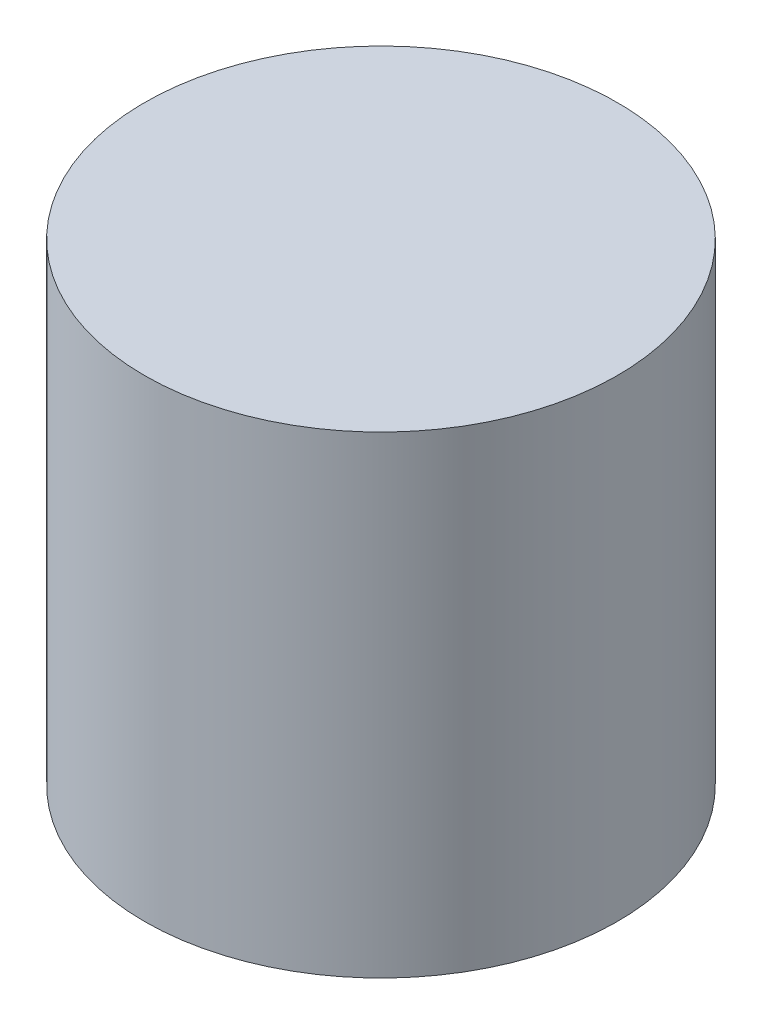
ISO-10303-21;
HEADER;
FILE_DESCRIPTION(('STEP AP214'),'2;1');
FILE_NAME('part.step','',(''),(''),'','','');
FILE_SCHEMA(('AUTOMOTIVE_DESIGN { 1 0 10303 214 1 1 1 1 }'));
ENDSEC;
DATA;
#1=APPLICATION_CONTEXT('core data for automotive mechanical design processes');
#2=APPLICATION_PROTOCOL_DEFINITION('international standard','automotive_design',2000,#1);
#3=PRODUCT_CONTEXT('',#1,'mechanical');
#4=PRODUCT('Part','Part','',(#3));
#5=PRODUCT_RELATED_PRODUCT_CATEGORY('part','',(#4));
#6=PRODUCT_DEFINITION_FORMATION('','',#4);
#7=PRODUCT_DEFINITION_CONTEXT('part definition',#1,'design');
#8=PRODUCT_DEFINITION('design','',#6,#7);
#9=PRODUCT_DEFINITION_SHAPE('','',#8);
#10=(LENGTH_UNIT() NAMED_UNIT(*) SI_UNIT(.MILLI.,.METRE.));
#11=(NAMED_UNIT(*) PLANE_ANGLE_UNIT() SI_UNIT($,.RADIAN.));
#12=(NAMED_UNIT(*) SI_UNIT($,.STERADIAN.) SOLID_ANGLE_UNIT());
#13=UNCERTAINTY_MEASURE_WITH_UNIT(LENGTH_MEASURE(1.E-05),#10,'distance_accuracy_value','');
#14=(GEOMETRIC_REPRESENTATION_CONTEXT(3) GLOBAL_UNCERTAINTY_ASSIGNED_CONTEXT((#13)) GLOBAL_UNIT_ASSIGNED_CONTEXT((#10,
#11,#12)) REPRESENTATION_CONTEXT('',''));
#15=CARTESIAN_POINT('',(0.,0.,0.));
#16=DIRECTION('',(0.,0.,1.));
#17=DIRECTION('',(1.,0.,0.));
#18=AXIS2_PLACEMENT_3D('',#15,#16,#17);
#19=CARTESIAN_POINT('',(0.,90.,0.));
#20=DIRECTION('',(0.,-1.,0.));
#21=DIRECTION('',(0.,0.,-1.));
#22=AXIS2_PLACEMENT_3D('',#19,#20,#21);
#23=CYLINDRICAL_SURFACE('',#22,45.);
#24=CARTESIAN_POINT('',(0.,90.,0.));
#25=DIRECTION('',(0.,1.,0.));
#26=DIRECTION('',(0.,0.,1.));
#27=AXIS2_PLACEMENT_3D('',#24,#25,#26);
#28=CIRCLE('',#27,45.);
#29=CARTESIAN_POINT('',(0.,90.,45.));
#30=VERTEX_POINT('',#29);
#31=EDGE_CURVE('E10',#30,#30,#28,.T.);
#32=ORIENTED_EDGE('',*,*,#31,.F.);
#33=EDGE_LOOP('',(#32));
#34=FACE_BOUND('',#33,.T.);
#35=CARTESIAN_POINT('',(0.,0.,0.));
#36=DIRECTION('',(0.,1.,0.));
#37=DIRECTION('',(0.,0.,1.));
#38=AXIS2_PLACEMENT_3D('',#35,#36,#37);
#39=CIRCLE('',#38,45.);
#40=CARTESIAN_POINT('',(0.,0.,45.));
#41=VERTEX_POINT('',#40);
#42=EDGE_CURVE('E42',#41,#41,#39,.T.);
#43=ORIENTED_EDGE('',*,*,#42,.T.);
#44=EDGE_LOOP('',(#43));
#45=FACE_BOUND('',#44,.T.);
#46=ADVANCED_FACE('F39',(#34,#45),#23,.T.);
#47=CARTESIAN_POINT('',(0.,90.,0.));
#48=DIRECTION('',(0.,1.,0.));
#49=DIRECTION('',(0.,0.,1.));
#50=AXIS2_PLACEMENT_3D('',#47,#48,#49);
#51=PLANE('',#50);
#52=ORIENTED_EDGE('',*,*,#31,.T.);
#53=EDGE_LOOP('',(#52));
#54=FACE_BOUND('',#53,.T.);
#55=ADVANCED_FACE('F56',(#54),#51,.T.);
#56=CARTESIAN_POINT('',(0.,0.,0.));
#57=DIRECTION('',(0.,1.,0.));
#58=DIRECTION('',(0.,0.,1.));
#59=AXIS2_PLACEMENT_3D('',#56,#57,#58);
#60=PLANE('',#59);
#61=ORIENTED_EDGE('',*,*,#42,.F.);
#62=EDGE_LOOP('',(#61));
#63=FACE_BOUND('',#62,.T.);
#64=ADVANCED_FACE('F54',(#63),#60,.F.);
#65=CLOSED_SHELL('',(#46,#55,#64));
#66=MANIFOLD_SOLID_BREP('B2',#65);
#67=ADVANCED_BREP_SHAPE_REPRESENTATION('',(#18,#66),#14);
#68=SHAPE_DEFINITION_REPRESENTATION(#9,#67);
ENDSEC;
END-ISO-10303-21;
